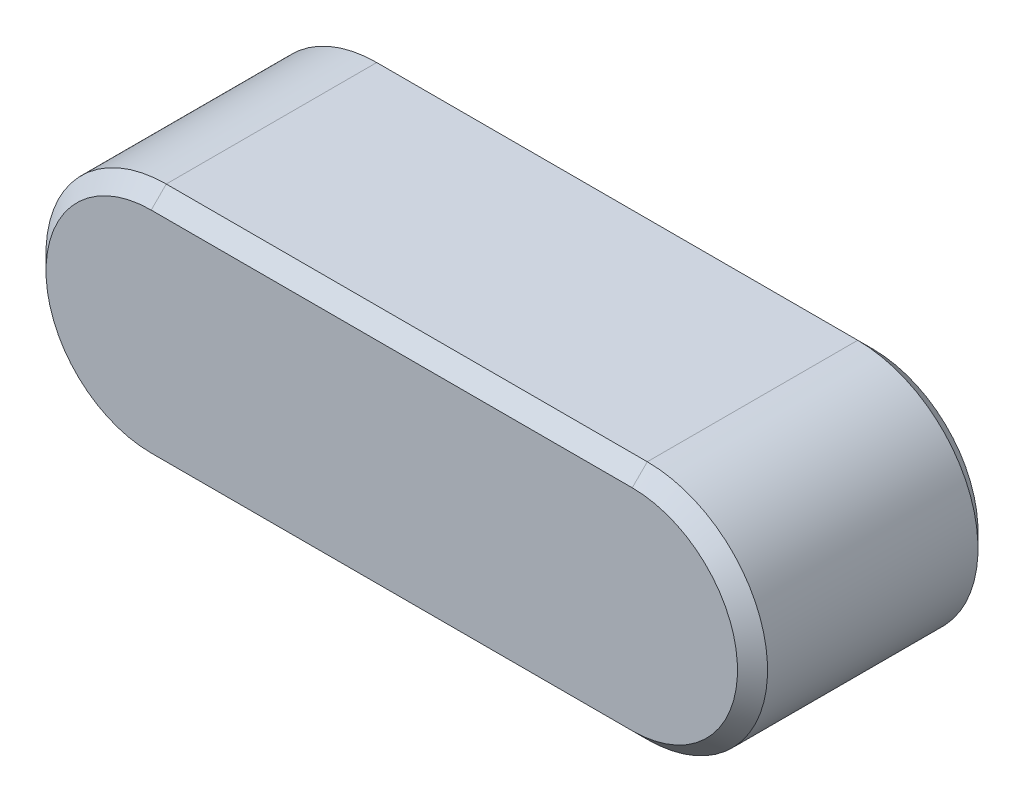
ISO-10303-21;
HEADER;
FILE_DESCRIPTION(('STEP AP214'),'2;1');
FILE_NAME('part.step','',(''),(''),'','','');
FILE_SCHEMA(('AUTOMOTIVE_DESIGN { 1 0 10303 214 1 1 1 1 }'));
ENDSEC;
DATA;
#1=APPLICATION_CONTEXT('core data for automotive mechanical design processes');
#2=APPLICATION_PROTOCOL_DEFINITION('international standard','automotive_design',2000,#1);
#3=PRODUCT_CONTEXT('',#1,'mechanical');
#4=PRODUCT('Part','Part','',(#3));
#5=PRODUCT_RELATED_PRODUCT_CATEGORY('part','',(#4));
#6=PRODUCT_DEFINITION_FORMATION('','',#4);
#7=PRODUCT_DEFINITION_CONTEXT('part definition',#1,'design');
#8=PRODUCT_DEFINITION('design','',#6,#7);
#9=PRODUCT_DEFINITION_SHAPE('','',#8);
#10=(LENGTH_UNIT() NAMED_UNIT(*) SI_UNIT(.MILLI.,.METRE.));
#11=(NAMED_UNIT(*) PLANE_ANGLE_UNIT() SI_UNIT($,.RADIAN.));
#12=(NAMED_UNIT(*) SI_UNIT($,.STERADIAN.) SOLID_ANGLE_UNIT());
#13=UNCERTAINTY_MEASURE_WITH_UNIT(LENGTH_MEASURE(1.E-05),#10,'distance_accuracy_value','');
#14=(GEOMETRIC_REPRESENTATION_CONTEXT(3) GLOBAL_UNCERTAINTY_ASSIGNED_CONTEXT((#13)) GLOBAL_UNIT_ASSIGNED_CONTEXT((#10,
#11,#12)) REPRESENTATION_CONTEXT('',''));
#15=CARTESIAN_POINT('',(0.,0.,0.));
#16=DIRECTION('',(0.,0.,1.));
#17=DIRECTION('',(1.,0.,0.));
#18=AXIS2_PLACEMENT_3D('',#15,#16,#17);
#19=CARTESIAN_POINT('',(-8.,0.,2.));
#20=DIRECTION('',(0.,0.,-1.));
#21=DIRECTION('',(-1.,0.,0.));
#22=AXIS2_PLACEMENT_3D('',#19,#20,#21);
#23=CYLINDRICAL_SURFACE('',#22,2.);
#24=DIRECTION('',(0.,0.,-1.));
#25=VECTOR('',#24,1.);
#26=CARTESIAN_POINT('',(-8.,-2.,2.));
#27=LINE('',#26,#25);
#28=CARTESIAN_POINT('',(-8.,-2.,1.75));
#29=VERTEX_POINT('',#28);
#30=CARTESIAN_POINT('',(-8.,-2.,-1.75));
#31=VERTEX_POINT('',#30);
#32=EDGE_CURVE('E121',#29,#31,#27,.T.);
#33=ORIENTED_EDGE('',*,*,#32,.F.);
#34=CARTESIAN_POINT('',(-8.,0.,1.75));
#35=DIRECTION('',(0.,0.,-1.));
#36=DIRECTION('',(-1.,0.,0.));
#37=AXIS2_PLACEMENT_3D('',#34,#35,#36);
#38=CIRCLE('',#37,2.);
#39=CARTESIAN_POINT('',(-8.,2.,1.75));
#40=VERTEX_POINT('',#39);
#41=EDGE_CURVE('E55',#29,#40,#38,.T.);
#42=ORIENTED_EDGE('',*,*,#41,.T.);
#43=DIRECTION('',(0.,0.,-1.));
#44=VECTOR('',#43,1.);
#45=CARTESIAN_POINT('',(-8.,2.,2.));
#46=LINE('',#45,#44);
#47=CARTESIAN_POINT('',(-8.,2.,-1.75));
#48=VERTEX_POINT('',#47);
#49=EDGE_CURVE('E159',#40,#48,#46,.T.);
#50=ORIENTED_EDGE('',*,*,#49,.T.);
#51=CARTESIAN_POINT('',(-8.,0.,-1.75));
#52=DIRECTION('',(0.,0.,-1.));
#53=DIRECTION('',(-1.,0.,0.));
#54=AXIS2_PLACEMENT_3D('',#51,#52,#53);
#55=CIRCLE('',#54,2.);
#56=EDGE_CURVE('E109',#48,#31,#55,.F.);
#57=ORIENTED_EDGE('',*,*,#56,.T.);
#58=EDGE_LOOP('',(#33,#42,#50,#57));
#59=FACE_BOUND('',#58,.T.);
#60=ADVANCED_FACE('F32',(#59),#23,.T.);
#61=CARTESIAN_POINT('',(0.,-2.,2.));
#62=DIRECTION('',(0.,1.,0.));
#63=DIRECTION('',(-1.,0.,0.));
#64=AXIS2_PLACEMENT_3D('',#61,#62,#63);
#65=PLANE('',#64);
#66=ORIENTED_EDGE('',*,*,#32,.T.);
#67=DIRECTION('',(1.,0.,0.));
#68=VECTOR('',#67,1.);
#69=CARTESIAN_POINT('',(0.,-2.,-1.75));
#70=LINE('',#69,#68);
#71=CARTESIAN_POINT('',(0.,-2.,-1.75));
#72=VERTEX_POINT('',#71);
#73=EDGE_CURVE('E120',#31,#72,#70,.T.);
#74=ORIENTED_EDGE('',*,*,#73,.T.);
#75=DIRECTION('',(0.,0.,-1.));
#76=VECTOR('',#75,1.);
#77=CARTESIAN_POINT('',(0.,-2.,2.));
#78=LINE('',#77,#76);
#79=CARTESIAN_POINT('',(0.,-2.,1.75));
#80=VERTEX_POINT('',#79);
#81=EDGE_CURVE('E103',#80,#72,#78,.T.);
#82=ORIENTED_EDGE('',*,*,#81,.F.);
#83=DIRECTION('',(-1.,0.,0.));
#84=VECTOR('',#83,1.);
#85=CARTESIAN_POINT('',(0.,-2.,1.75));
#86=LINE('',#85,#84);
#87=EDGE_CURVE('E118',#80,#29,#86,.T.);
#88=ORIENTED_EDGE('',*,*,#87,.T.);
#89=EDGE_LOOP('',(#66,#74,#82,#88));
#90=FACE_BOUND('',#89,.T.);
#91=ADVANCED_FACE('F117',(#90),#65,.F.);
#92=CARTESIAN_POINT('',(0.,0.,2.));
#93=DIRECTION('',(0.,0.,-1.));
#94=DIRECTION('',(-1.,0.,0.));
#95=AXIS2_PLACEMENT_3D('',#92,#93,#94);
#96=CYLINDRICAL_SURFACE('',#95,2.);
#97=DIRECTION('',(0.,0.,-1.));
#98=VECTOR('',#97,1.);
#99=CARTESIAN_POINT('',(0.,2.,2.));
#100=LINE('',#99,#98);
#101=CARTESIAN_POINT('',(0.,2.,1.75));
#102=VERTEX_POINT('',#101);
#103=CARTESIAN_POINT('',(0.,2.,-1.75));
#104=VERTEX_POINT('',#103);
#105=EDGE_CURVE('E104',#102,#104,#100,.T.);
#106=ORIENTED_EDGE('',*,*,#105,.F.);
#107=CARTESIAN_POINT('',(0.,0.,1.75));
#108=DIRECTION('',(0.,0.,-1.));
#109=DIRECTION('',(-1.,0.,0.));
#110=AXIS2_PLACEMENT_3D('',#107,#108,#109);
#111=CIRCLE('',#110,2.);
#112=EDGE_CURVE('E100',#102,#80,#111,.T.);
#113=ORIENTED_EDGE('',*,*,#112,.T.);
#114=ORIENTED_EDGE('',*,*,#81,.T.);
#115=CARTESIAN_POINT('',(0.,0.,-1.75));
#116=DIRECTION('',(0.,0.,-1.));
#117=DIRECTION('',(-1.,0.,0.));
#118=AXIS2_PLACEMENT_3D('',#115,#116,#117);
#119=CIRCLE('',#118,2.);
#120=EDGE_CURVE('E110',#72,#104,#119,.F.);
#121=ORIENTED_EDGE('',*,*,#120,.T.);
#122=EDGE_LOOP('',(#106,#113,#114,#121));
#123=FACE_BOUND('',#122,.T.);
#124=ADVANCED_FACE('F102',(#123),#96,.T.);
#125=CARTESIAN_POINT('',(-8.,2.,2.));
#126=DIRECTION('',(0.,-1.,0.));
#127=DIRECTION('',(1.,0.,0.));
#128=AXIS2_PLACEMENT_3D('',#125,#126,#127);
#129=PLANE('',#128);
#130=ORIENTED_EDGE('',*,*,#49,.F.);
#131=DIRECTION('',(1.,0.,0.));
#132=VECTOR('',#131,1.);
#133=CARTESIAN_POINT('',(-8.,2.,1.75));
#134=LINE('',#133,#132);
#135=EDGE_CURVE('E11',#40,#102,#134,.T.);
#136=ORIENTED_EDGE('',*,*,#135,.T.);
#137=ORIENTED_EDGE('',*,*,#105,.T.);
#138=DIRECTION('',(-1.,0.,0.));
#139=VECTOR('',#138,1.);
#140=CARTESIAN_POINT('',(-8.,2.,-1.75));
#141=LINE('',#140,#139);
#142=EDGE_CURVE('E41',#104,#48,#141,.T.);
#143=ORIENTED_EDGE('',*,*,#142,.T.);
#144=EDGE_LOOP('',(#130,#136,#137,#143));
#145=FACE_BOUND('',#144,.T.);
#146=ADVANCED_FACE('F209',(#145),#129,.F.);
#147=CARTESIAN_POINT('',(-8.,0.,2.));
#148=DIRECTION('',(0.,0.,-1.));
#149=DIRECTION('',(-1.,0.,0.));
#150=AXIS2_PLACEMENT_3D('',#147,#148,#149);
#151=PLANE('',#150);
#152=CARTESIAN_POINT('',(-8.,0.,2.));
#153=DIRECTION('',(0.,0.,-1.));
#154=DIRECTION('',(-1.,0.,0.));
#155=AXIS2_PLACEMENT_3D('',#152,#153,#154);
#156=CIRCLE('',#155,1.75);
#157=CARTESIAN_POINT('',(-8.,1.75,2.));
#158=VERTEX_POINT('',#157);
#159=CARTESIAN_POINT('',(-8.,-1.75,2.));
#160=VERTEX_POINT('',#159);
#161=EDGE_CURVE('E180',#158,#160,#156,.F.);
#162=ORIENTED_EDGE('',*,*,#161,.T.);
#163=DIRECTION('',(1.,0.,0.));
#164=VECTOR('',#163,1.);
#165=CARTESIAN_POINT('',(-8.,-1.75,2.));
#166=LINE('',#165,#164);
#167=CARTESIAN_POINT('',(0.,-1.75,2.));
#168=VERTEX_POINT('',#167);
#169=EDGE_CURVE('E183',#160,#168,#166,.T.);
#170=ORIENTED_EDGE('',*,*,#169,.T.);
#171=CARTESIAN_POINT('',(0.,0.,2.));
#172=DIRECTION('',(0.,0.,-1.));
#173=DIRECTION('',(-1.,0.,0.));
#174=AXIS2_PLACEMENT_3D('',#171,#172,#173);
#175=CIRCLE('',#174,1.75);
#176=CARTESIAN_POINT('',(0.,1.75,2.));
#177=VERTEX_POINT('',#176);
#178=EDGE_CURVE('E132',#168,#177,#175,.F.);
#179=ORIENTED_EDGE('',*,*,#178,.T.);
#180=DIRECTION('',(-1.,0.,0.));
#181=VECTOR('',#180,1.);
#182=CARTESIAN_POINT('',(-8.,1.75,2.));
#183=LINE('',#182,#181);
#184=EDGE_CURVE('E178',#177,#158,#183,.T.);
#185=ORIENTED_EDGE('',*,*,#184,.T.);
#186=EDGE_LOOP('',(#162,#170,#179,#185));
#187=FACE_BOUND('',#186,.T.);
#188=ADVANCED_FACE('F212',(#187),#151,.F.);
#189=CARTESIAN_POINT('',(-8.,0.,-2.));
#190=DIRECTION('',(0.,0.,-1.));
#191=DIRECTION('',(-1.,0.,0.));
#192=AXIS2_PLACEMENT_3D('',#189,#190,#191);
#193=PLANE('',#192);
#194=CARTESIAN_POINT('',(0.,0.,-2.));
#195=DIRECTION('',(0.,0.,-1.));
#196=DIRECTION('',(-1.,0.,0.));
#197=AXIS2_PLACEMENT_3D('',#194,#195,#196);
#198=CIRCLE('',#197,1.75);
#199=CARTESIAN_POINT('',(0.,1.75,-2.));
#200=VERTEX_POINT('',#199);
#201=CARTESIAN_POINT('',(0.,-1.75,-2.));
#202=VERTEX_POINT('',#201);
#203=EDGE_CURVE('E173',#200,#202,#198,.T.);
#204=ORIENTED_EDGE('',*,*,#203,.T.);
#205=DIRECTION('',(-1.,0.,0.));
#206=VECTOR('',#205,1.);
#207=CARTESIAN_POINT('',(-8.,-1.75,-2.));
#208=LINE('',#207,#206);
#209=CARTESIAN_POINT('',(-8.,-1.75,-2.));
#210=VERTEX_POINT('',#209);
#211=EDGE_CURVE('E175',#202,#210,#208,.T.);
#212=ORIENTED_EDGE('',*,*,#211,.T.);
#213=CARTESIAN_POINT('',(-8.,0.,-2.));
#214=DIRECTION('',(0.,0.,-1.));
#215=DIRECTION('',(-1.,0.,0.));
#216=AXIS2_PLACEMENT_3D('',#213,#214,#215);
#217=CIRCLE('',#216,1.75);
#218=CARTESIAN_POINT('',(-8.,1.75,-2.));
#219=VERTEX_POINT('',#218);
#220=EDGE_CURVE('E171',#210,#219,#217,.T.);
#221=ORIENTED_EDGE('',*,*,#220,.T.);
#222=DIRECTION('',(1.,0.,0.));
#223=VECTOR('',#222,1.);
#224=CARTESIAN_POINT('',(0.,1.75,-2.));
#225=LINE('',#224,#223);
#226=EDGE_CURVE('E169',#219,#200,#225,.T.);
#227=ORIENTED_EDGE('',*,*,#226,.T.);
#228=EDGE_LOOP('',(#204,#212,#221,#227));
#229=FACE_BOUND('',#228,.T.);
#230=ADVANCED_FACE('F213',(#229),#193,.T.);
#231=CARTESIAN_POINT('',(-8.,2.,-1.75));
#232=DIRECTION('',(0.,0.707106781186545,-0.70710678118655));
#233=DIRECTION('',(0.,0.70710678118655,0.707106781186545));
#234=AXIS2_PLACEMENT_3D('',#231,#232,#233);
#235=PLANE('',#234);
#236=DIRECTION('',(0.,0.70710678118655,0.707106781186545));
#237=VECTOR('',#236,1.);
#238=CARTESIAN_POINT('',(0.,1.75,-2.));
#239=LINE('',#238,#237);
#240=EDGE_CURVE('E151',#200,#104,#239,.T.);
#241=ORIENTED_EDGE('',*,*,#240,.F.);
#242=ORIENTED_EDGE('',*,*,#226,.F.);
#243=DIRECTION('',(0.,-0.70710678118655,-0.707106781186545));
#244=VECTOR('',#243,1.);
#245=CARTESIAN_POINT('',(-8.,2.,-1.75));
#246=LINE('',#245,#244);
#247=EDGE_CURVE('E138',#48,#219,#246,.T.);
#248=ORIENTED_EDGE('',*,*,#247,.F.);
#249=ORIENTED_EDGE('',*,*,#142,.F.);
#250=EDGE_LOOP('',(#241,#242,#248,#249));
#251=FACE_BOUND('',#250,.T.);
#252=ADVANCED_FACE('F216',(#251),#235,.T.);
#253=CARTESIAN_POINT('',(-8.,0.,-1.75));
#254=DIRECTION('',(0.,0.,1.));
#255=DIRECTION('',(1.,0.,0.));
#256=AXIS2_PLACEMENT_3D('',#253,#254,#255);
#257=CONICAL_SURFACE('',#256,2.,0.785398163397452);
#258=ORIENTED_EDGE('',*,*,#247,.T.);
#259=ORIENTED_EDGE('',*,*,#220,.F.);
#260=DIRECTION('',(0.,0.70710678118655,-0.707106781186545));
#261=VECTOR('',#260,1.);
#262=CARTESIAN_POINT('',(-8.,-2.,-1.75));
#263=LINE('',#262,#261);
#264=EDGE_CURVE('E145',#31,#210,#263,.T.);
#265=ORIENTED_EDGE('',*,*,#264,.F.);
#266=ORIENTED_EDGE('',*,*,#56,.F.);
#267=EDGE_LOOP('',(#258,#259,#265,#266));
#268=FACE_BOUND('',#267,.T.);
#269=ADVANCED_FACE('F188',(#268),#257,.T.);
#270=CARTESIAN_POINT('',(0.,0.,-1.75));
#271=DIRECTION('',(0.,0.,1.));
#272=DIRECTION('',(1.,0.,0.));
#273=AXIS2_PLACEMENT_3D('',#270,#271,#272);
#274=CONICAL_SURFACE('',#273,2.,0.785398163397452);
#275=ORIENTED_EDGE('',*,*,#240,.T.);
#276=ORIENTED_EDGE('',*,*,#120,.F.);
#277=DIRECTION('',(0.,-0.70710678118655,0.707106781186545));
#278=VECTOR('',#277,1.);
#279=CARTESIAN_POINT('',(0.,-1.75,-2.));
#280=LINE('',#279,#278);
#281=EDGE_CURVE('E141',#202,#72,#280,.T.);
#282=ORIENTED_EDGE('',*,*,#281,.F.);
#283=ORIENTED_EDGE('',*,*,#203,.F.);
#284=EDGE_LOOP('',(#275,#276,#282,#283));
#285=FACE_BOUND('',#284,.T.);
#286=ADVANCED_FACE('F191',(#285),#274,.T.);
#287=CARTESIAN_POINT('',(0.,-2.,-1.75));
#288=DIRECTION('',(0.,-0.707106781186545,-0.70710678118655));
#289=DIRECTION('',(0.,0.70710678118655,-0.707106781186545));
#290=AXIS2_PLACEMENT_3D('',#287,#288,#289);
#291=PLANE('',#290);
#292=ORIENTED_EDGE('',*,*,#264,.T.);
#293=ORIENTED_EDGE('',*,*,#211,.F.);
#294=ORIENTED_EDGE('',*,*,#281,.T.);
#295=ORIENTED_EDGE('',*,*,#73,.F.);
#296=EDGE_LOOP('',(#292,#293,#294,#295));
#297=FACE_BOUND('',#296,.T.);
#298=ADVANCED_FACE('F189',(#297),#291,.T.);
#299=CARTESIAN_POINT('',(-8.,1.75,2.));
#300=DIRECTION('',(0.,-0.70710678118655,-0.707106781186545));
#301=DIRECTION('',(0.,0.707106781186545,-0.70710678118655));
#302=AXIS2_PLACEMENT_3D('',#299,#300,#301);
#303=PLANE('',#302);
#304=DIRECTION('',(0.,-0.707106781186545,0.70710678118655));
#305=VECTOR('',#304,1.);
#306=CARTESIAN_POINT('',(0.,2.,1.75));
#307=LINE('',#306,#305);
#308=EDGE_CURVE('E135',#102,#177,#307,.T.);
#309=ORIENTED_EDGE('',*,*,#308,.F.);
#310=ORIENTED_EDGE('',*,*,#135,.F.);
#311=DIRECTION('',(0.,0.707106781186545,-0.70710678118655));
#312=VECTOR('',#311,1.);
#313=CARTESIAN_POINT('',(-8.,1.75,2.));
#314=LINE('',#313,#312);
#315=EDGE_CURVE('E36',#158,#40,#314,.T.);
#316=ORIENTED_EDGE('',*,*,#315,.F.);
#317=ORIENTED_EDGE('',*,*,#184,.F.);
#318=EDGE_LOOP('',(#309,#310,#316,#317));
#319=FACE_BOUND('',#318,.T.);
#320=ADVANCED_FACE('F34',(#319),#303,.F.);
#321=CARTESIAN_POINT('',(-8.,0.,2.));
#322=DIRECTION('',(0.,0.,-1.));
#323=DIRECTION('',(-1.,0.,0.));
#324=AXIS2_PLACEMENT_3D('',#321,#322,#323);
#325=CONICAL_SURFACE('',#324,1.75,0.785398163397445);
#326=ORIENTED_EDGE('',*,*,#315,.T.);
#327=ORIENTED_EDGE('',*,*,#41,.F.);
#328=DIRECTION('',(0.,-0.707106781186545,-0.70710678118655));
#329=VECTOR('',#328,1.);
#330=CARTESIAN_POINT('',(-8.,-1.75,2.));
#331=LINE('',#330,#329);
#332=EDGE_CURVE('E129',#160,#29,#331,.T.);
#333=ORIENTED_EDGE('',*,*,#332,.F.);
#334=ORIENTED_EDGE('',*,*,#161,.F.);
#335=EDGE_LOOP('',(#326,#327,#333,#334));
#336=FACE_BOUND('',#335,.T.);
#337=ADVANCED_FACE('F197',(#336),#325,.T.);
#338=CARTESIAN_POINT('',(0.,0.,2.));
#339=DIRECTION('',(0.,0.,-1.));
#340=DIRECTION('',(-1.,0.,0.));
#341=AXIS2_PLACEMENT_3D('',#338,#339,#340);
#342=CONICAL_SURFACE('',#341,1.75,0.785398163397445);
#343=ORIENTED_EDGE('',*,*,#308,.T.);
#344=ORIENTED_EDGE('',*,*,#178,.F.);
#345=DIRECTION('',(0.,0.707106781186545,0.70710678118655));
#346=VECTOR('',#345,1.);
#347=CARTESIAN_POINT('',(0.,-2.,1.75));
#348=LINE('',#347,#346);
#349=EDGE_CURVE('E126',#80,#168,#348,.T.);
#350=ORIENTED_EDGE('',*,*,#349,.F.);
#351=ORIENTED_EDGE('',*,*,#112,.F.);
#352=EDGE_LOOP('',(#343,#344,#350,#351));
#353=FACE_BOUND('',#352,.T.);
#354=ADVANCED_FACE('F131',(#353),#342,.T.);
#355=CARTESIAN_POINT('',(-8.,-1.75,2.));
#356=DIRECTION('',(0.,0.707106781186547,-0.707106781186547));
#357=DIRECTION('',(0.,0.707106781186548,0.707106781186548));
#358=AXIS2_PLACEMENT_3D('',#355,#356,#357);
#359=PLANE('',#358);
#360=ORIENTED_EDGE('',*,*,#332,.T.);
#361=ORIENTED_EDGE('',*,*,#87,.F.);
#362=ORIENTED_EDGE('',*,*,#349,.T.);
#363=ORIENTED_EDGE('',*,*,#169,.F.);
#364=EDGE_LOOP('',(#360,#361,#362,#363));
#365=FACE_BOUND('',#364,.T.);
#366=ADVANCED_FACE('F124',(#365),#359,.F.);
#367=CLOSED_SHELL('',(#60,#91,#124,#146,#188,#230,#252,#269,#286,#298,#320,#337,#354,#366));
#368=MANIFOLD_SOLID_BREP('B2',#367);
#369=ADVANCED_BREP_SHAPE_REPRESENTATION('',(#18,#368),#14);
#370=SHAPE_DEFINITION_REPRESENTATION(#9,#369);
ENDSEC;
END-ISO-10303-21;
